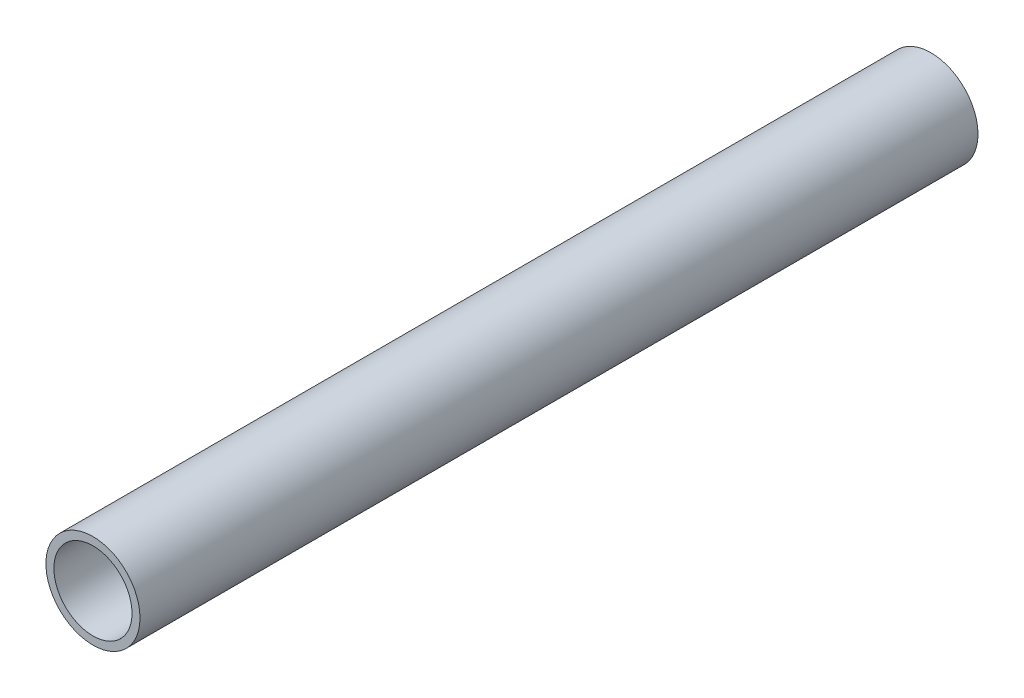
ISO-10303-21;
HEADER;
FILE_DESCRIPTION(('STEP AP214'),'2;1');
FILE_NAME('part.step','',(''),(''),'','','');
FILE_SCHEMA(('AUTOMOTIVE_DESIGN { 1 0 10303 214 1 1 1 1 }'));
ENDSEC;
DATA;
#1=APPLICATION_CONTEXT('core data for automotive mechanical design processes');
#2=APPLICATION_PROTOCOL_DEFINITION('international standard','automotive_design',2000,#1);
#3=PRODUCT_CONTEXT('',#1,'mechanical');
#4=PRODUCT('Part','Part','',(#3));
#5=PRODUCT_RELATED_PRODUCT_CATEGORY('part','',(#4));
#6=PRODUCT_DEFINITION_FORMATION('','',#4);
#7=PRODUCT_DEFINITION_CONTEXT('part definition',#1,'design');
#8=PRODUCT_DEFINITION('design','',#6,#7);
#9=PRODUCT_DEFINITION_SHAPE('','',#8);
#10=(LENGTH_UNIT() NAMED_UNIT(*) SI_UNIT(.MILLI.,.METRE.));
#11=(NAMED_UNIT(*) PLANE_ANGLE_UNIT() SI_UNIT($,.RADIAN.));
#12=(NAMED_UNIT(*) SI_UNIT($,.STERADIAN.) SOLID_ANGLE_UNIT());
#13=UNCERTAINTY_MEASURE_WITH_UNIT(LENGTH_MEASURE(1.E-05),#10,'distance_accuracy_value','');
#14=(GEOMETRIC_REPRESENTATION_CONTEXT(3) GLOBAL_UNCERTAINTY_ASSIGNED_CONTEXT((#13)) GLOBAL_UNIT_ASSIGNED_CONTEXT((#10,
#11,#12)) REPRESENTATION_CONTEXT('',''));
#15=CARTESIAN_POINT('',(0.,0.,0.));
#16=DIRECTION('',(0.,0.,1.));
#17=DIRECTION('',(1.,0.,0.));
#18=AXIS2_PLACEMENT_3D('',#15,#16,#17);
#19=CARTESIAN_POINT('',(0.,0.,0.));
#20=DIRECTION('',(0.,0.,1.));
#21=DIRECTION('',(1.,0.,0.));
#22=AXIS2_PLACEMENT_3D('',#19,#20,#21);
#23=CYLINDRICAL_SURFACE('',#22,17.4625);
#24=CARTESIAN_POINT('',(0.,0.,374.65));
#25=DIRECTION('',(0.,0.,1.));
#26=DIRECTION('',(1.,0.,0.));
#27=AXIS2_PLACEMENT_3D('',#24,#25,#26);
#28=CIRCLE('',#27,17.4625);
#29=CARTESIAN_POINT('',(17.4625,0.,374.65));
#30=VERTEX_POINT('',#29);
#31=EDGE_CURVE('E27',#30,#30,#28,.T.);
#32=ORIENTED_EDGE('',*,*,#31,.T.);
#33=EDGE_LOOP('',(#32));
#34=FACE_BOUND('',#33,.T.);
#35=CARTESIAN_POINT('',(0.,0.,0.));
#36=DIRECTION('',(0.,0.,1.));
#37=DIRECTION('',(1.,0.,0.));
#38=AXIS2_PLACEMENT_3D('',#35,#36,#37);
#39=CIRCLE('',#38,17.4625);
#40=CARTESIAN_POINT('',(17.4625,0.,0.));
#41=VERTEX_POINT('',#40);
#42=EDGE_CURVE('E18',#41,#41,#39,.T.);
#43=ORIENTED_EDGE('',*,*,#42,.F.);
#44=EDGE_LOOP('',(#43));
#45=FACE_BOUND('',#44,.T.);
#46=ADVANCED_FACE('F15',(#34,#45),#23,.F.);
#47=CARTESIAN_POINT('',(0.,0.,0.));
#48=DIRECTION('',(0.,0.,-1.));
#49=DIRECTION('',(-1.,0.,0.));
#50=AXIS2_PLACEMENT_3D('',#47,#48,#49);
#51=PLANE('',#50);
#52=ORIENTED_EDGE('',*,*,#42,.T.);
#53=EDGE_LOOP('',(#52));
#54=FACE_BOUND('',#53,.T.);
#55=CARTESIAN_POINT('',(0.,0.,0.));
#56=DIRECTION('',(0.,0.,1.));
#57=DIRECTION('',(1.,0.,0.));
#58=AXIS2_PLACEMENT_3D('',#55,#56,#57);
#59=CIRCLE('',#58,21.0312);
#60=CARTESIAN_POINT('',(21.0312,0.,0.));
#61=VERTEX_POINT('',#60);
#62=EDGE_CURVE('E22',#61,#61,#59,.T.);
#63=ORIENTED_EDGE('',*,*,#62,.F.);
#64=EDGE_LOOP('',(#63));
#65=FACE_BOUND('',#64,.T.);
#66=ADVANCED_FACE('F35',(#54,#65),#51,.T.);
#67=CARTESIAN_POINT('',(0.,0.,374.65));
#68=DIRECTION('',(0.,0.,-1.));
#69=DIRECTION('',(-1.,0.,0.));
#70=AXIS2_PLACEMENT_3D('',#67,#68,#69);
#71=PLANE('',#70);
#72=ORIENTED_EDGE('',*,*,#31,.F.);
#73=EDGE_LOOP('',(#72));
#74=FACE_BOUND('',#73,.T.);
#75=CARTESIAN_POINT('',(0.,0.,374.65));
#76=DIRECTION('',(0.,0.,1.));
#77=DIRECTION('',(1.,0.,0.));
#78=AXIS2_PLACEMENT_3D('',#75,#76,#77);
#79=CIRCLE('',#78,21.0312);
#80=CARTESIAN_POINT('',(21.0312,0.,374.65));
#81=VERTEX_POINT('',#80);
#82=EDGE_CURVE('E10',#81,#81,#79,.F.);
#83=ORIENTED_EDGE('',*,*,#82,.F.);
#84=EDGE_LOOP('',(#83));
#85=FACE_BOUND('',#84,.T.);
#86=ADVANCED_FACE('F43',(#74,#85),#71,.F.);
#87=CARTESIAN_POINT('',(0.,0.,0.));
#88=DIRECTION('',(0.,0.,1.));
#89=DIRECTION('',(1.,0.,0.));
#90=AXIS2_PLACEMENT_3D('',#87,#88,#89);
#91=CYLINDRICAL_SURFACE('',#90,21.0312);
#92=ORIENTED_EDGE('',*,*,#82,.T.);
#93=EDGE_LOOP('',(#92));
#94=FACE_BOUND('',#93,.T.);
#95=ORIENTED_EDGE('',*,*,#62,.T.);
#96=EDGE_LOOP('',(#95));
#97=FACE_BOUND('',#96,.T.);
#98=ADVANCED_FACE('F44',(#94,#97),#91,.T.);
#99=CLOSED_SHELL('',(#46,#66,#86,#98));
#100=MANIFOLD_SOLID_BREP('B1',#99);
#101=ADVANCED_BREP_SHAPE_REPRESENTATION('',(#18,#100),#14);
#102=SHAPE_DEFINITION_REPRESENTATION(#9,#101);
ENDSEC;
END-ISO-10303-21;
